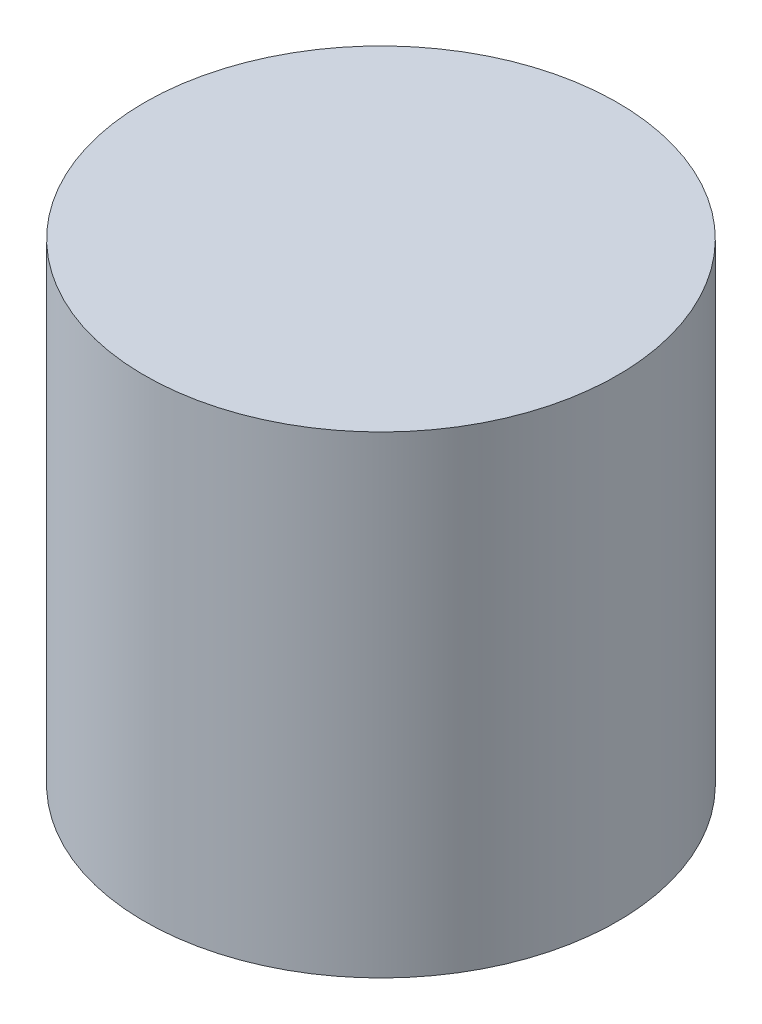
ISO-10303-21;
HEADER;
FILE_DESCRIPTION(('STEP AP214'),'2;1');
FILE_NAME('part.step','',(''),(''),'','','');
FILE_SCHEMA(('AUTOMOTIVE_DESIGN { 1 0 10303 214 1 1 1 1 }'));
ENDSEC;
DATA;
#1=APPLICATION_CONTEXT('core data for automotive mechanical design processes');
#2=APPLICATION_PROTOCOL_DEFINITION('international standard','automotive_design',2000,#1);
#3=PRODUCT_CONTEXT('',#1,'mechanical');
#4=PRODUCT('Part','Part','',(#3));
#5=PRODUCT_RELATED_PRODUCT_CATEGORY('part','',(#4));
#6=PRODUCT_DEFINITION_FORMATION('','',#4);
#7=PRODUCT_DEFINITION_CONTEXT('part definition',#1,'design');
#8=PRODUCT_DEFINITION('design','',#6,#7);
#9=PRODUCT_DEFINITION_SHAPE('','',#8);
#10=(LENGTH_UNIT() NAMED_UNIT(*) SI_UNIT(.MILLI.,.METRE.));
#11=(NAMED_UNIT(*) PLANE_ANGLE_UNIT() SI_UNIT($,.RADIAN.));
#12=(NAMED_UNIT(*) SI_UNIT($,.STERADIAN.) SOLID_ANGLE_UNIT());
#13=UNCERTAINTY_MEASURE_WITH_UNIT(LENGTH_MEASURE(1.E-05),#10,'distance_accuracy_value','');
#14=(GEOMETRIC_REPRESENTATION_CONTEXT(3) GLOBAL_UNCERTAINTY_ASSIGNED_CONTEXT((#13)) GLOBAL_UNIT_ASSIGNED_CONTEXT((#10,
#11,#12)) REPRESENTATION_CONTEXT('',''));
#15=CARTESIAN_POINT('',(0.,0.,0.));
#16=DIRECTION('',(0.,0.,1.));
#17=DIRECTION('',(1.,0.,0.));
#18=AXIS2_PLACEMENT_3D('',#15,#16,#17);
#19=CARTESIAN_POINT('',(0.,50.8,0.));
#20=DIRECTION('',(0.,-1.,0.));
#21=DIRECTION('',(1.,0.,0.));
#22=AXIS2_PLACEMENT_3D('',#19,#20,#21);
#23=PLANE('',#22);
#24=CARTESIAN_POINT('',(0.,50.8,0.));
#25=DIRECTION('',(0.,1.,0.));
#26=DIRECTION('',(-1.,0.,0.));
#27=AXIS2_PLACEMENT_3D('',#24,#25,#26);
#28=CIRCLE('',#27,50.8);
#29=CARTESIAN_POINT('',(-50.8,50.8,0.));
#30=VERTEX_POINT('',#29);
#31=EDGE_CURVE('E49',#30,#30,#28,.T.);
#32=ORIENTED_EDGE('',*,*,#31,.T.);
#33=EDGE_LOOP('',(#32));
#34=FACE_BOUND('',#33,.T.);
#35=ADVANCED_FACE('F34',(#34),#23,.F.);
#36=CARTESIAN_POINT('',(0.,-50.8,0.));
#37=DIRECTION('',(0.,1.,0.));
#38=DIRECTION('',(-1.,0.,0.));
#39=AXIS2_PLACEMENT_3D('',#36,#37,#38);
#40=PLANE('',#39);
#41=CARTESIAN_POINT('',(0.,-50.8,0.));
#42=DIRECTION('',(0.,1.,0.));
#43=DIRECTION('',(-1.,0.,0.));
#44=AXIS2_PLACEMENT_3D('',#41,#42,#43);
#45=CIRCLE('',#44,50.8);
#46=CARTESIAN_POINT('',(-50.8,-50.8,0.));
#47=VERTEX_POINT('',#46);
#48=EDGE_CURVE('E45',#47,#47,#45,.T.);
#49=ORIENTED_EDGE('',*,*,#48,.F.);
#50=EDGE_LOOP('',(#49));
#51=FACE_BOUND('',#50,.T.);
#52=ADVANCED_FACE('F59',(#51),#40,.F.);
#53=CARTESIAN_POINT('',(0.,50.8,0.));
#54=DIRECTION('',(0.,1.,0.));
#55=DIRECTION('',(-1.,0.,0.));
#56=AXIS2_PLACEMENT_3D('',#53,#54,#55);
#57=CYLINDRICAL_SURFACE('',#56,50.8);
#58=ORIENTED_EDGE('',*,*,#31,.F.);
#59=EDGE_LOOP('',(#58));
#60=FACE_BOUND('',#59,.T.);
#61=ORIENTED_EDGE('',*,*,#48,.T.);
#62=EDGE_LOOP('',(#61));
#63=FACE_BOUND('',#62,.T.);
#64=ADVANCED_FACE('F56',(#60,#63),#57,.T.);
#65=CLOSED_SHELL('',(#35,#52,#64));
#66=CARTESIAN_POINT('',(0.,44.45,0.));
#67=DIRECTION('',(0.,1.,0.));
#68=DIRECTION('',(-1.,0.,0.));
#69=AXIS2_PLACEMENT_3D('',#66,#67,#68);
#70=PLANE('',#69);
#71=CARTESIAN_POINT('',(0.,44.45,0.));
#72=DIRECTION('',(0.,1.,0.));
#73=DIRECTION('',(-1.,0.,0.));
#74=AXIS2_PLACEMENT_3D('',#71,#72,#73);
#75=CIRCLE('',#74,44.45);
#76=CARTESIAN_POINT('',(-44.45,44.45,0.));
#77=VERTEX_POINT('',#76);
#78=EDGE_CURVE('E10',#77,#77,#75,.T.);
#79=ORIENTED_EDGE('',*,*,#78,.F.);
#80=EDGE_LOOP('',(#79));
#81=FACE_BOUND('',#80,.T.);
#82=ADVANCED_FACE('F75',(#81),#70,.F.);
#83=CARTESIAN_POINT('',(0.,50.8,0.));
#84=DIRECTION('',(0.,1.,0.));
#85=DIRECTION('',(-1.,0.,0.));
#86=AXIS2_PLACEMENT_3D('',#83,#84,#85);
#87=CYLINDRICAL_SURFACE('',#86,44.45);
#88=CARTESIAN_POINT('',(0.,-44.45,0.));
#89=DIRECTION('',(0.,1.,0.));
#90=DIRECTION('',(-1.,0.,0.));
#91=AXIS2_PLACEMENT_3D('',#88,#89,#90);
#92=CIRCLE('',#91,44.45);
#93=CARTESIAN_POINT('',(-44.45,-44.45,0.));
#94=VERTEX_POINT('',#93);
#95=EDGE_CURVE('E41',#94,#94,#92,.T.);
#96=ORIENTED_EDGE('',*,*,#95,.F.);
#97=EDGE_LOOP('',(#96));
#98=FACE_BOUND('',#97,.T.);
#99=ORIENTED_EDGE('',*,*,#78,.T.);
#100=EDGE_LOOP('',(#99));
#101=FACE_BOUND('',#100,.T.);
#102=ADVANCED_FACE('F72',(#98,#101),#87,.F.);
#103=CARTESIAN_POINT('',(0.,-44.45,0.));
#104=DIRECTION('',(0.,-1.,0.));
#105=DIRECTION('',(1.,0.,0.));
#106=AXIS2_PLACEMENT_3D('',#103,#104,#105);
#107=PLANE('',#106);
#108=ORIENTED_EDGE('',*,*,#95,.T.);
#109=EDGE_LOOP('',(#108));
#110=FACE_BOUND('',#109,.T.);
#111=ADVANCED_FACE('F69',(#110),#107,.F.);
#112=CLOSED_SHELL('',(#82,#102,#111));
#113=ORIENTED_CLOSED_SHELL('',*,#112,.T.);
#114=BREP_WITH_VOIDS('B2',#65,(#113));
#115=ADVANCED_BREP_SHAPE_REPRESENTATION('',(#18,#114),#14);
#116=SHAPE_DEFINITION_REPRESENTATION(#9,#115);
ENDSEC;
END-ISO-10303-21;
